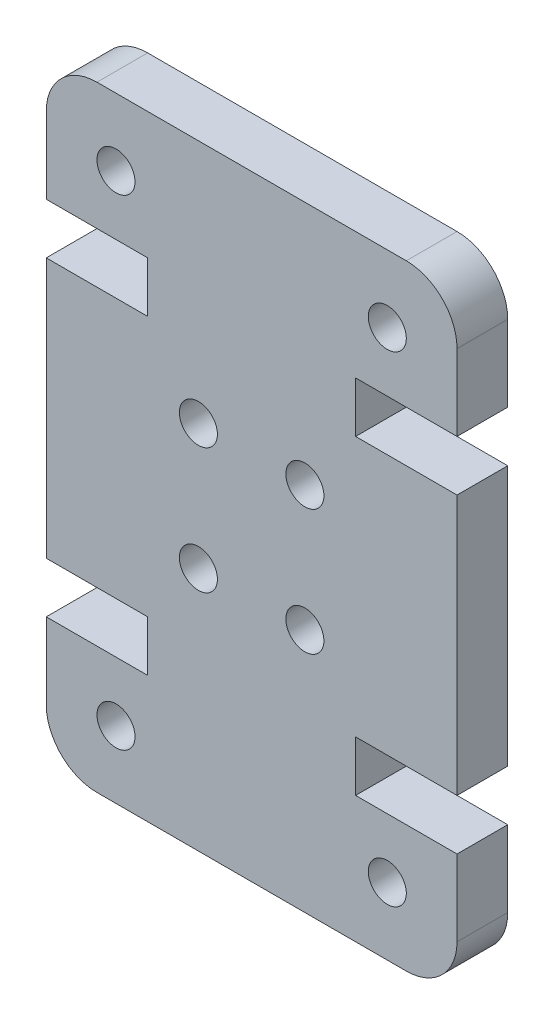
ISO-10303-21;
HEADER;
FILE_DESCRIPTION(('STEP AP214'),'2;1');
FILE_NAME('part.step','',(''),(''),'','','');
FILE_SCHEMA(('AUTOMOTIVE_DESIGN { 1 0 10303 214 1 1 1 1 }'));
ENDSEC;
DATA;
#1=APPLICATION_CONTEXT('core data for automotive mechanical design processes');
#2=APPLICATION_PROTOCOL_DEFINITION('international standard','automotive_design',2000,#1);
#3=PRODUCT_CONTEXT('',#1,'mechanical');
#4=PRODUCT('Part','Part','',(#3));
#5=PRODUCT_RELATED_PRODUCT_CATEGORY('part','',(#4));
#6=PRODUCT_DEFINITION_FORMATION('','',#4);
#7=PRODUCT_DEFINITION_CONTEXT('part definition',#1,'design');
#8=PRODUCT_DEFINITION('design','',#6,#7);
#9=PRODUCT_DEFINITION_SHAPE('','',#8);
#10=(LENGTH_UNIT() NAMED_UNIT(*) SI_UNIT(.MILLI.,.METRE.));
#11=(NAMED_UNIT(*) PLANE_ANGLE_UNIT() SI_UNIT($,.RADIAN.));
#12=(NAMED_UNIT(*) SI_UNIT($,.STERADIAN.) SOLID_ANGLE_UNIT());
#13=UNCERTAINTY_MEASURE_WITH_UNIT(LENGTH_MEASURE(1.E-05),#10,'distance_accuracy_value','');
#14=(GEOMETRIC_REPRESENTATION_CONTEXT(3) GLOBAL_UNCERTAINTY_ASSIGNED_CONTEXT((#13)) GLOBAL_UNIT_ASSIGNED_CONTEXT((#10,
#11,#12)) REPRESENTATION_CONTEXT('',''));
#15=CARTESIAN_POINT('',(0.,0.,0.));
#16=DIRECTION('',(0.,0.,1.));
#17=DIRECTION('',(1.,0.,0.));
#18=AXIS2_PLACEMENT_3D('',#15,#16,#17);
#19=CARTESIAN_POINT('',(14.2,2.,2.));
#20=DIRECTION('',(0.,0.,-1.));
#21=DIRECTION('',(-1.,0.,0.));
#22=AXIS2_PLACEMENT_3D('',#19,#20,#21);
#23=PLANE('',#22);
#24=CARTESIAN_POINT('',(6.00000000000001,9.65355116894447,2.));
#25=DIRECTION('',(0.,0.,1.));
#26=DIRECTION('',(1.,0.,0.));
#27=AXIS2_PLACEMENT_3D('',#24,#25,#26);
#28=CIRCLE('',#27,0.749999999999999);
#29=CARTESIAN_POINT('',(6.75,9.65355116894447,2.));
#30=VERTEX_POINT('',#29);
#31=EDGE_CURVE('E464',#30,#30,#28,.T.);
#32=ORIENTED_EDGE('',*,*,#31,.F.);
#33=EDGE_LOOP('',(#32));
#34=FACE_BOUND('',#33,.T.);
#35=CARTESIAN_POINT('',(10.2,14.6064488310555,2.));
#36=DIRECTION('',(0.,0.,1.));
#37=DIRECTION('',(1.,0.,0.));
#38=AXIS2_PLACEMENT_3D('',#35,#36,#37);
#39=CIRCLE('',#38,0.749999999999998);
#40=CARTESIAN_POINT('',(10.95,14.6064488310555,2.));
#41=VERTEX_POINT('',#40);
#42=EDGE_CURVE('E476',#41,#41,#39,.T.);
#43=ORIENTED_EDGE('',*,*,#42,.F.);
#44=EDGE_LOOP('',(#43));
#45=FACE_BOUND('',#44,.T.);
#46=CARTESIAN_POINT('',(2.75000000000003,21.606448831055,2.));
#47=DIRECTION('',(0.,0.,1.));
#48=DIRECTION('',(-1.,0.,0.));
#49=AXIS2_PLACEMENT_3D('',#46,#47,#48);
#50=CIRCLE('',#49,0.749999999999999);
#51=CARTESIAN_POINT('',(2.00000000000003,21.606448831055,2.));
#52=VERTEX_POINT('',#51);
#53=EDGE_CURVE('E488',#52,#52,#50,.T.);
#54=ORIENTED_EDGE('',*,*,#53,.F.);
#55=EDGE_LOOP('',(#54));
#56=FACE_BOUND('',#55,.T.);
#57=CARTESIAN_POINT('',(13.45,2.65355116894501,2.));
#58=DIRECTION('',(0.,0.,1.));
#59=DIRECTION('',(-1.,0.,0.));
#60=AXIS2_PLACEMENT_3D('',#57,#58,#59);
#61=CIRCLE('',#60,0.750000000000004);
#62=CARTESIAN_POINT('',(12.7,2.65355116894501,2.));
#63=VERTEX_POINT('',#62);
#64=EDGE_CURVE('E230',#63,#63,#61,.T.);
#65=ORIENTED_EDGE('',*,*,#64,.F.);
#66=EDGE_LOOP('',(#65));
#67=FACE_BOUND('',#66,.T.);
#68=CARTESIAN_POINT('',(14.2,2.,2.));
#69=DIRECTION('',(0.,0.,1.));
#70=DIRECTION('',(-1.,0.,0.));
#71=AXIS2_PLACEMENT_3D('',#68,#69,#70);
#72=CIRCLE('',#71,2.);
#73=CARTESIAN_POINT('',(14.2,0.,2.));
#74=VERTEX_POINT('',#73);
#75=CARTESIAN_POINT('',(16.2,2.,2.));
#76=VERTEX_POINT('',#75);
#77=EDGE_CURVE('E273',#74,#76,#72,.T.);
#78=ORIENTED_EDGE('',*,*,#77,.T.);
#79=DIRECTION('',(0.,1.,0.));
#80=VECTOR('',#79,1.);
#81=CARTESIAN_POINT('',(16.2,2.,2.));
#82=LINE('',#81,#80);
#83=CARTESIAN_POINT('',(16.2,4.99999999999945,2.));
#84=VERTEX_POINT('',#83);
#85=EDGE_CURVE('E141',#76,#84,#82,.T.);
#86=ORIENTED_EDGE('',*,*,#85,.T.);
#87=DIRECTION('',(-1.,0.,0.));
#88=VECTOR('',#87,1.);
#89=CARTESIAN_POINT('',(12.2,4.99999999999945,2.));
#90=LINE('',#89,#88);
#91=CARTESIAN_POINT('',(12.2,4.99999999999945,2.));
#92=VERTEX_POINT('',#91);
#93=EDGE_CURVE('E336',#84,#92,#90,.T.);
#94=ORIENTED_EDGE('',*,*,#93,.T.);
#95=DIRECTION('',(0.,1.,0.));
#96=VECTOR('',#95,1.);
#97=CARTESIAN_POINT('',(12.2,6.99999999999945,2.));
#98=LINE('',#97,#96);
#99=CARTESIAN_POINT('',(12.2,6.99999999999945,2.));
#100=VERTEX_POINT('',#99);
#101=EDGE_CURVE('E355',#92,#100,#98,.T.);
#102=ORIENTED_EDGE('',*,*,#101,.T.);
#103=DIRECTION('',(1.,0.,0.));
#104=VECTOR('',#103,1.);
#105=CARTESIAN_POINT('',(16.2,6.99999999999945,2.));
#106=LINE('',#105,#104);
#107=CARTESIAN_POINT('',(16.2,6.99999999999945,2.));
#108=VERTEX_POINT('',#107);
#109=EDGE_CURVE('E352',#100,#108,#106,.T.);
#110=ORIENTED_EDGE('',*,*,#109,.T.);
#111=DIRECTION('',(0.,1.,0.));
#112=VECTOR('',#111,1.);
#113=CARTESIAN_POINT('',(16.2,17.2600000000005,2.));
#114=LINE('',#113,#112);
#115=CARTESIAN_POINT('',(16.2,17.2600000000005,2.));
#116=VERTEX_POINT('',#115);
#117=EDGE_CURVE('E354',#108,#116,#114,.T.);
#118=ORIENTED_EDGE('',*,*,#117,.T.);
#119=DIRECTION('',(-1.,0.,0.));
#120=VECTOR('',#119,1.);
#121=CARTESIAN_POINT('',(16.2,17.2600000000005,2.));
#122=LINE('',#121,#120);
#123=CARTESIAN_POINT('',(12.2,17.2600000000005,2.));
#124=VERTEX_POINT('',#123);
#125=EDGE_CURVE('E357',#116,#124,#122,.T.);
#126=ORIENTED_EDGE('',*,*,#125,.T.);
#127=DIRECTION('',(0.,1.,0.));
#128=VECTOR('',#127,1.);
#129=CARTESIAN_POINT('',(12.2,17.2600000000005,2.));
#130=LINE('',#129,#128);
#131=CARTESIAN_POINT('',(12.2,19.2600000000005,2.));
#132=VERTEX_POINT('',#131);
#133=EDGE_CURVE('E363',#124,#132,#130,.T.);
#134=ORIENTED_EDGE('',*,*,#133,.T.);
#135=DIRECTION('',(1.,0.,0.));
#136=VECTOR('',#135,1.);
#137=CARTESIAN_POINT('',(12.2,19.2600000000005,2.));
#138=LINE('',#137,#136);
#139=CARTESIAN_POINT('',(16.2,19.2600000000005,2.));
#140=VERTEX_POINT('',#139);
#141=EDGE_CURVE('E365',#132,#140,#138,.T.);
#142=ORIENTED_EDGE('',*,*,#141,.T.);
#143=DIRECTION('',(0.,1.,0.));
#144=VECTOR('',#143,1.);
#145=CARTESIAN_POINT('',(16.2,22.26,2.));
#146=LINE('',#145,#144);
#147=CARTESIAN_POINT('',(16.2,22.26,2.));
#148=VERTEX_POINT('',#147);
#149=EDGE_CURVE('E367',#140,#148,#146,.T.);
#150=ORIENTED_EDGE('',*,*,#149,.T.);
#151=CARTESIAN_POINT('',(14.2,22.26,2.));
#152=DIRECTION('',(0.,0.,1.));
#153=DIRECTION('',(1.,0.,0.));
#154=AXIS2_PLACEMENT_3D('',#151,#152,#153);
#155=CIRCLE('',#154,2.);
#156=CARTESIAN_POINT('',(14.2,24.26,2.));
#157=VERTEX_POINT('',#156);
#158=EDGE_CURVE('E369',#148,#157,#155,.T.);
#159=ORIENTED_EDGE('',*,*,#158,.T.);
#160=DIRECTION('',(-1.,0.,0.));
#161=VECTOR('',#160,1.);
#162=CARTESIAN_POINT('',(1.99999999999999,24.26,2.));
#163=LINE('',#162,#161);
#164=CARTESIAN_POINT('',(1.99999999999999,24.26,2.));
#165=VERTEX_POINT('',#164);
#166=EDGE_CURVE('E371',#157,#165,#163,.T.);
#167=ORIENTED_EDGE('',*,*,#166,.T.);
#168=CARTESIAN_POINT('',(2.,22.26,2.));
#169=DIRECTION('',(0.,0.,1.));
#170=DIRECTION('',(-1.,0.,0.));
#171=AXIS2_PLACEMENT_3D('',#168,#169,#170);
#172=CIRCLE('',#171,2.);
#173=CARTESIAN_POINT('',(0.,22.26,2.));
#174=VERTEX_POINT('',#173);
#175=EDGE_CURVE('E373',#165,#174,#172,.T.);
#176=ORIENTED_EDGE('',*,*,#175,.T.);
#177=DIRECTION('',(0.,-1.,0.));
#178=VECTOR('',#177,1.);
#179=CARTESIAN_POINT('',(0.,22.26,2.));
#180=LINE('',#179,#178);
#181=CARTESIAN_POINT('',(0.,19.2600000000005,2.));
#182=VERTEX_POINT('',#181);
#183=EDGE_CURVE('E375',#174,#182,#180,.T.);
#184=ORIENTED_EDGE('',*,*,#183,.T.);
#185=DIRECTION('',(1.,0.,0.));
#186=VECTOR('',#185,1.);
#187=CARTESIAN_POINT('',(3.99999999999999,19.2600000000005,2.));
#188=LINE('',#187,#186);
#189=CARTESIAN_POINT('',(3.99999999999999,19.2600000000005,2.));
#190=VERTEX_POINT('',#189);
#191=EDGE_CURVE('E377',#182,#190,#188,.T.);
#192=ORIENTED_EDGE('',*,*,#191,.T.);
#193=DIRECTION('',(0.,-1.,0.));
#194=VECTOR('',#193,1.);
#195=CARTESIAN_POINT('',(3.99999999999999,17.2600000000005,2.));
#196=LINE('',#195,#194);
#197=CARTESIAN_POINT('',(3.99999999999999,17.2600000000005,2.));
#198=VERTEX_POINT('',#197);
#199=EDGE_CURVE('E379',#190,#198,#196,.T.);
#200=ORIENTED_EDGE('',*,*,#199,.T.);
#201=DIRECTION('',(-1.,0.,0.));
#202=VECTOR('',#201,1.);
#203=CARTESIAN_POINT('',(0.,17.2600000000005,2.));
#204=LINE('',#203,#202);
#205=CARTESIAN_POINT('',(0.,17.2600000000005,2.));
#206=VERTEX_POINT('',#205);
#207=EDGE_CURVE('E381',#198,#206,#204,.T.);
#208=ORIENTED_EDGE('',*,*,#207,.T.);
#209=DIRECTION('',(0.,-1.,0.));
#210=VECTOR('',#209,1.);
#211=CARTESIAN_POINT('',(0.,17.2600000000005,2.));
#212=LINE('',#211,#210);
#213=CARTESIAN_POINT('',(0.,6.99999999999945,2.));
#214=VERTEX_POINT('',#213);
#215=EDGE_CURVE('E383',#206,#214,#212,.T.);
#216=ORIENTED_EDGE('',*,*,#215,.T.);
#217=DIRECTION('',(1.,0.,0.));
#218=VECTOR('',#217,1.);
#219=CARTESIAN_POINT('',(0.,6.99999999999945,2.));
#220=LINE('',#219,#218);
#221=CARTESIAN_POINT('',(4.,6.99999999999945,2.));
#222=VERTEX_POINT('',#221);
#223=EDGE_CURVE('E385',#214,#222,#220,.T.);
#224=ORIENTED_EDGE('',*,*,#223,.T.);
#225=DIRECTION('',(0.,-1.,0.));
#226=VECTOR('',#225,1.);
#227=CARTESIAN_POINT('',(4.,6.99999999999945,2.));
#228=LINE('',#227,#226);
#229=CARTESIAN_POINT('',(4.,4.99999999999945,2.));
#230=VERTEX_POINT('',#229);
#231=EDGE_CURVE('E387',#222,#230,#228,.T.);
#232=ORIENTED_EDGE('',*,*,#231,.T.);
#233=DIRECTION('',(-1.,0.,0.));
#234=VECTOR('',#233,1.);
#235=CARTESIAN_POINT('',(4.,4.99999999999945,2.));
#236=LINE('',#235,#234);
#237=CARTESIAN_POINT('',(0.,4.99999999999945,2.));
#238=VERTEX_POINT('',#237);
#239=EDGE_CURVE('E208',#230,#238,#236,.T.);
#240=ORIENTED_EDGE('',*,*,#239,.T.);
#241=DIRECTION('',(0.,-1.,0.));
#242=VECTOR('',#241,1.);
#243=CARTESIAN_POINT('',(0.,2.,2.));
#244=LINE('',#243,#242);
#245=CARTESIAN_POINT('',(0.,2.,2.));
#246=VERTEX_POINT('',#245);
#247=EDGE_CURVE('E202',#238,#246,#244,.T.);
#248=ORIENTED_EDGE('',*,*,#247,.T.);
#249=CARTESIAN_POINT('',(2.,2.,2.));
#250=DIRECTION('',(0.,0.,1.));
#251=DIRECTION('',(1.,0.,0.));
#252=AXIS2_PLACEMENT_3D('',#249,#250,#251);
#253=CIRCLE('',#252,2.);
#254=CARTESIAN_POINT('',(2.,0.,2.));
#255=VERTEX_POINT('',#254);
#256=EDGE_CURVE('E206',#246,#255,#253,.T.);
#257=ORIENTED_EDGE('',*,*,#256,.T.);
#258=DIRECTION('',(1.,0.,0.));
#259=VECTOR('',#258,1.);
#260=CARTESIAN_POINT('',(2.,0.,2.));
#261=LINE('',#260,#259);
#262=EDGE_CURVE('E50',#255,#74,#261,.T.);
#263=ORIENTED_EDGE('',*,*,#262,.T.);
#264=EDGE_LOOP('',(#78,#86,#94,#102,#110,#118,#126,#134,#142,#150,#159,#167,#176,#184,#192,#200,
#208,#216,#224,#232,#240,#248,#257,#263));
#265=FACE_BOUND('',#264,.T.);
#266=CARTESIAN_POINT('',(10.2,9.65355116894447,2.));
#267=DIRECTION('',(0.,0.,1.));
#268=DIRECTION('',(-1.,0.,0.));
#269=AXIS2_PLACEMENT_3D('',#266,#267,#268);
#270=CIRCLE('',#269,0.749999999999998);
#271=CARTESIAN_POINT('',(9.44999999999999,9.65355116894447,2.));
#272=VERTEX_POINT('',#271);
#273=EDGE_CURVE('E494',#272,#272,#270,.T.);
#274=ORIENTED_EDGE('',*,*,#273,.F.);
#275=EDGE_LOOP('',(#274));
#276=FACE_BOUND('',#275,.T.);
#277=CARTESIAN_POINT('',(6.,14.6064488310555,2.));
#278=DIRECTION('',(0.,0.,1.));
#279=DIRECTION('',(-1.,0.,0.));
#280=AXIS2_PLACEMENT_3D('',#277,#278,#279);
#281=CIRCLE('',#280,0.75);
#282=CARTESIAN_POINT('',(5.25,14.6064488310555,2.));
#283=VERTEX_POINT('',#282);
#284=EDGE_CURVE('E482',#283,#283,#281,.T.);
#285=ORIENTED_EDGE('',*,*,#284,.F.);
#286=EDGE_LOOP('',(#285));
#287=FACE_BOUND('',#286,.T.);
#288=CARTESIAN_POINT('',(13.45,21.606448831055,2.));
#289=DIRECTION('',(0.,0.,1.));
#290=DIRECTION('',(1.,0.,0.));
#291=AXIS2_PLACEMENT_3D('',#288,#289,#290);
#292=CIRCLE('',#291,0.750000000000004);
#293=CARTESIAN_POINT('',(14.2,21.606448831055,2.));
#294=VERTEX_POINT('',#293);
#295=EDGE_CURVE('E470',#294,#294,#292,.T.);
#296=ORIENTED_EDGE('',*,*,#295,.F.);
#297=EDGE_LOOP('',(#296));
#298=FACE_BOUND('',#297,.T.);
#299=CARTESIAN_POINT('',(2.75000000000003,2.65355116894501,2.));
#300=DIRECTION('',(0.,0.,1.));
#301=DIRECTION('',(1.,0.,0.));
#302=AXIS2_PLACEMENT_3D('',#299,#300,#301);
#303=CIRCLE('',#302,0.749999999999999);
#304=CARTESIAN_POINT('',(3.50000000000003,2.65355116894501,2.));
#305=VERTEX_POINT('',#304);
#306=EDGE_CURVE('E455',#305,#305,#303,.T.);
#307=ORIENTED_EDGE('',*,*,#306,.F.);
#308=EDGE_LOOP('',(#307));
#309=FACE_BOUND('',#308,.T.);
#310=ADVANCED_FACE('F33',(#34,#45,#56,#67,#265,#276,#287,#298,#309),#23,.F.);
#311=CARTESIAN_POINT('',(14.2,2.,0.));
#312=DIRECTION('',(0.,0.,-1.));
#313=DIRECTION('',(-1.,0.,0.));
#314=AXIS2_PLACEMENT_3D('',#311,#312,#313);
#315=PLANE('',#314);
#316=CARTESIAN_POINT('',(6.00000000000001,9.65355116894447,0.));
#317=DIRECTION('',(0.,0.,1.));
#318=DIRECTION('',(1.,0.,0.));
#319=AXIS2_PLACEMENT_3D('',#316,#317,#318);
#320=CIRCLE('',#319,0.749999999999999);
#321=CARTESIAN_POINT('',(6.75,9.65355116894447,0.));
#322=VERTEX_POINT('',#321);
#323=EDGE_CURVE('E461',#322,#322,#320,.T.);
#324=ORIENTED_EDGE('',*,*,#323,.T.);
#325=EDGE_LOOP('',(#324));
#326=FACE_BOUND('',#325,.T.);
#327=CARTESIAN_POINT('',(10.2,14.6064488310555,0.));
#328=DIRECTION('',(0.,0.,1.));
#329=DIRECTION('',(1.,0.,0.));
#330=AXIS2_PLACEMENT_3D('',#327,#328,#329);
#331=CIRCLE('',#330,0.749999999999998);
#332=CARTESIAN_POINT('',(10.95,14.6064488310555,0.));
#333=VERTEX_POINT('',#332);
#334=EDGE_CURVE('E473',#333,#333,#331,.T.);
#335=ORIENTED_EDGE('',*,*,#334,.T.);
#336=EDGE_LOOP('',(#335));
#337=FACE_BOUND('',#336,.T.);
#338=CARTESIAN_POINT('',(2.75000000000003,21.606448831055,0.));
#339=DIRECTION('',(0.,0.,1.));
#340=DIRECTION('',(-1.,0.,0.));
#341=AXIS2_PLACEMENT_3D('',#338,#339,#340);
#342=CIRCLE('',#341,0.749999999999999);
#343=CARTESIAN_POINT('',(2.00000000000003,21.606448831055,0.));
#344=VERTEX_POINT('',#343);
#345=EDGE_CURVE('E485',#344,#344,#342,.T.);
#346=ORIENTED_EDGE('',*,*,#345,.T.);
#347=EDGE_LOOP('',(#346));
#348=FACE_BOUND('',#347,.T.);
#349=CARTESIAN_POINT('',(13.45,2.65355116894501,0.));
#350=DIRECTION('',(0.,0.,1.));
#351=DIRECTION('',(-1.,0.,0.));
#352=AXIS2_PLACEMENT_3D('',#349,#350,#351);
#353=CIRCLE('',#352,0.750000000000004);
#354=CARTESIAN_POINT('',(12.7,2.65355116894501,0.));
#355=VERTEX_POINT('',#354);
#356=EDGE_CURVE('E497',#355,#355,#353,.T.);
#357=ORIENTED_EDGE('',*,*,#356,.T.);
#358=EDGE_LOOP('',(#357));
#359=FACE_BOUND('',#358,.T.);
#360=CARTESIAN_POINT('',(14.2,2.,0.));
#361=DIRECTION('',(0.,0.,1.));
#362=DIRECTION('',(-1.,0.,0.));
#363=AXIS2_PLACEMENT_3D('',#360,#361,#362);
#364=CIRCLE('',#363,2.);
#365=CARTESIAN_POINT('',(14.2,0.,0.));
#366=VERTEX_POINT('',#365);
#367=CARTESIAN_POINT('',(16.2,2.,0.));
#368=VERTEX_POINT('',#367);
#369=EDGE_CURVE('E226',#366,#368,#364,.T.);
#370=ORIENTED_EDGE('',*,*,#369,.F.);
#371=DIRECTION('',(1.,0.,0.));
#372=VECTOR('',#371,1.);
#373=CARTESIAN_POINT('',(2.,0.,0.));
#374=LINE('',#373,#372);
#375=CARTESIAN_POINT('',(2.,0.,0.));
#376=VERTEX_POINT('',#375);
#377=EDGE_CURVE('E133',#376,#366,#374,.T.);
#378=ORIENTED_EDGE('',*,*,#377,.F.);
#379=CARTESIAN_POINT('',(2.,2.,0.));
#380=DIRECTION('',(0.,0.,1.));
#381=DIRECTION('',(1.,0.,0.));
#382=AXIS2_PLACEMENT_3D('',#379,#380,#381);
#383=CIRCLE('',#382,2.);
#384=CARTESIAN_POINT('',(0.,2.,0.));
#385=VERTEX_POINT('',#384);
#386=EDGE_CURVE('E127',#385,#376,#383,.T.);
#387=ORIENTED_EDGE('',*,*,#386,.F.);
#388=DIRECTION('',(0.,-1.,0.));
#389=VECTOR('',#388,1.);
#390=CARTESIAN_POINT('',(0.,2.,0.));
#391=LINE('',#390,#389);
#392=CARTESIAN_POINT('',(0.,4.99999999999945,0.));
#393=VERTEX_POINT('',#392);
#394=EDGE_CURVE('E216',#393,#385,#391,.T.);
#395=ORIENTED_EDGE('',*,*,#394,.F.);
#396=DIRECTION('',(-1.,0.,0.));
#397=VECTOR('',#396,1.);
#398=CARTESIAN_POINT('',(4.,4.99999999999945,0.));
#399=LINE('',#398,#397);
#400=CARTESIAN_POINT('',(4.,4.99999999999945,0.));
#401=VERTEX_POINT('',#400);
#402=EDGE_CURVE('E268',#401,#393,#399,.T.);
#403=ORIENTED_EDGE('',*,*,#402,.F.);
#404=DIRECTION('',(0.,-1.,0.));
#405=VECTOR('',#404,1.);
#406=CARTESIAN_POINT('',(4.,6.99999999999945,0.));
#407=LINE('',#406,#405);
#408=CARTESIAN_POINT('',(4.,6.99999999999945,0.));
#409=VERTEX_POINT('',#408);
#410=EDGE_CURVE('E266',#409,#401,#407,.T.);
#411=ORIENTED_EDGE('',*,*,#410,.F.);
#412=DIRECTION('',(1.,0.,0.));
#413=VECTOR('',#412,1.);
#414=CARTESIAN_POINT('',(0.,6.99999999999945,0.));
#415=LINE('',#414,#413);
#416=CARTESIAN_POINT('',(0.,6.99999999999945,0.));
#417=VERTEX_POINT('',#416);
#418=EDGE_CURVE('E264',#417,#409,#415,.T.);
#419=ORIENTED_EDGE('',*,*,#418,.F.);
#420=DIRECTION('',(0.,-1.,0.));
#421=VECTOR('',#420,1.);
#422=CARTESIAN_POINT('',(0.,17.2600000000005,0.));
#423=LINE('',#422,#421);
#424=CARTESIAN_POINT('',(0.,17.2600000000005,0.));
#425=VERTEX_POINT('',#424);
#426=EDGE_CURVE('E262',#425,#417,#423,.T.);
#427=ORIENTED_EDGE('',*,*,#426,.F.);
#428=DIRECTION('',(-1.,0.,0.));
#429=VECTOR('',#428,1.);
#430=CARTESIAN_POINT('',(0.,17.2600000000005,0.));
#431=LINE('',#430,#429);
#432=CARTESIAN_POINT('',(3.99999999999999,17.2600000000005,0.));
#433=VERTEX_POINT('',#432);
#434=EDGE_CURVE('E260',#433,#425,#431,.T.);
#435=ORIENTED_EDGE('',*,*,#434,.F.);
#436=DIRECTION('',(0.,-1.,0.));
#437=VECTOR('',#436,1.);
#438=CARTESIAN_POINT('',(3.99999999999999,17.2600000000005,0.));
#439=LINE('',#438,#437);
#440=CARTESIAN_POINT('',(3.99999999999999,19.2600000000005,0.));
#441=VERTEX_POINT('',#440);
#442=EDGE_CURVE('E258',#441,#433,#439,.T.);
#443=ORIENTED_EDGE('',*,*,#442,.F.);
#444=DIRECTION('',(1.,0.,0.));
#445=VECTOR('',#444,1.);
#446=CARTESIAN_POINT('',(3.99999999999999,19.2600000000005,0.));
#447=LINE('',#446,#445);
#448=CARTESIAN_POINT('',(0.,19.2600000000005,0.));
#449=VERTEX_POINT('',#448);
#450=EDGE_CURVE('E256',#449,#441,#447,.T.);
#451=ORIENTED_EDGE('',*,*,#450,.F.);
#452=DIRECTION('',(0.,-1.,0.));
#453=VECTOR('',#452,1.);
#454=CARTESIAN_POINT('',(0.,22.26,0.));
#455=LINE('',#454,#453);
#456=CARTESIAN_POINT('',(0.,22.26,0.));
#457=VERTEX_POINT('',#456);
#458=EDGE_CURVE('E254',#457,#449,#455,.T.);
#459=ORIENTED_EDGE('',*,*,#458,.F.);
#460=CARTESIAN_POINT('',(2.,22.26,0.));
#461=DIRECTION('',(0.,0.,1.));
#462=DIRECTION('',(-1.,0.,0.));
#463=AXIS2_PLACEMENT_3D('',#460,#461,#462);
#464=CIRCLE('',#463,2.);
#465=CARTESIAN_POINT('',(1.99999999999999,24.26,0.));
#466=VERTEX_POINT('',#465);
#467=EDGE_CURVE('E252',#466,#457,#464,.T.);
#468=ORIENTED_EDGE('',*,*,#467,.F.);
#469=DIRECTION('',(-1.,0.,0.));
#470=VECTOR('',#469,1.);
#471=CARTESIAN_POINT('',(1.99999999999999,24.26,0.));
#472=LINE('',#471,#470);
#473=CARTESIAN_POINT('',(14.2,24.26,0.));
#474=VERTEX_POINT('',#473);
#475=EDGE_CURVE('E250',#474,#466,#472,.T.);
#476=ORIENTED_EDGE('',*,*,#475,.F.);
#477=CARTESIAN_POINT('',(14.2,22.26,0.));
#478=DIRECTION('',(0.,0.,1.));
#479=DIRECTION('',(1.,0.,0.));
#480=AXIS2_PLACEMENT_3D('',#477,#478,#479);
#481=CIRCLE('',#480,2.);
#482=CARTESIAN_POINT('',(16.2,22.26,0.));
#483=VERTEX_POINT('',#482);
#484=EDGE_CURVE('E248',#483,#474,#481,.T.);
#485=ORIENTED_EDGE('',*,*,#484,.F.);
#486=DIRECTION('',(0.,1.,0.));
#487=VECTOR('',#486,1.);
#488=CARTESIAN_POINT('',(16.2,22.26,0.));
#489=LINE('',#488,#487);
#490=CARTESIAN_POINT('',(16.2,19.2600000000005,0.));
#491=VERTEX_POINT('',#490);
#492=EDGE_CURVE('E246',#491,#483,#489,.T.);
#493=ORIENTED_EDGE('',*,*,#492,.F.);
#494=DIRECTION('',(1.,0.,0.));
#495=VECTOR('',#494,1.);
#496=CARTESIAN_POINT('',(12.2,19.2600000000005,0.));
#497=LINE('',#496,#495);
#498=CARTESIAN_POINT('',(12.2,19.2600000000005,0.));
#499=VERTEX_POINT('',#498);
#500=EDGE_CURVE('E244',#499,#491,#497,.T.);
#501=ORIENTED_EDGE('',*,*,#500,.F.);
#502=DIRECTION('',(0.,1.,0.));
#503=VECTOR('',#502,1.);
#504=CARTESIAN_POINT('',(12.2,17.2600000000005,0.));
#505=LINE('',#504,#503);
#506=CARTESIAN_POINT('',(12.2,17.2600000000005,0.));
#507=VERTEX_POINT('',#506);
#508=EDGE_CURVE('E242',#507,#499,#505,.T.);
#509=ORIENTED_EDGE('',*,*,#508,.F.);
#510=DIRECTION('',(-1.,0.,0.));
#511=VECTOR('',#510,1.);
#512=CARTESIAN_POINT('',(16.2,17.2600000000005,0.));
#513=LINE('',#512,#511);
#514=CARTESIAN_POINT('',(16.2,17.2600000000005,0.));
#515=VERTEX_POINT('',#514);
#516=EDGE_CURVE('E240',#515,#507,#513,.T.);
#517=ORIENTED_EDGE('',*,*,#516,.F.);
#518=DIRECTION('',(0.,1.,0.));
#519=VECTOR('',#518,1.);
#520=CARTESIAN_POINT('',(16.2,17.2600000000005,0.));
#521=LINE('',#520,#519);
#522=CARTESIAN_POINT('',(16.2,6.99999999999945,0.));
#523=VERTEX_POINT('',#522);
#524=EDGE_CURVE('E238',#523,#515,#521,.T.);
#525=ORIENTED_EDGE('',*,*,#524,.F.);
#526=DIRECTION('',(1.,0.,0.));
#527=VECTOR('',#526,1.);
#528=CARTESIAN_POINT('',(16.2,6.99999999999945,0.));
#529=LINE('',#528,#527);
#530=CARTESIAN_POINT('',(12.2,6.99999999999945,0.));
#531=VERTEX_POINT('',#530);
#532=EDGE_CURVE('E236',#531,#523,#529,.T.);
#533=ORIENTED_EDGE('',*,*,#532,.F.);
#534=DIRECTION('',(0.,1.,0.));
#535=VECTOR('',#534,1.);
#536=CARTESIAN_POINT('',(12.2,6.99999999999945,0.));
#537=LINE('',#536,#535);
#538=CARTESIAN_POINT('',(12.2,4.99999999999945,0.));
#539=VERTEX_POINT('',#538);
#540=EDGE_CURVE('E234',#539,#531,#537,.T.);
#541=ORIENTED_EDGE('',*,*,#540,.F.);
#542=DIRECTION('',(-1.,0.,0.));
#543=VECTOR('',#542,1.);
#544=CARTESIAN_POINT('',(12.2,4.99999999999945,0.));
#545=LINE('',#544,#543);
#546=CARTESIAN_POINT('',(16.2,4.99999999999945,0.));
#547=VERTEX_POINT('',#546);
#548=EDGE_CURVE('E232',#547,#539,#545,.T.);
#549=ORIENTED_EDGE('',*,*,#548,.F.);
#550=DIRECTION('',(0.,1.,0.));
#551=VECTOR('',#550,1.);
#552=CARTESIAN_POINT('',(16.2,2.,0.));
#553=LINE('',#552,#551);
#554=EDGE_CURVE('E229',#368,#547,#553,.T.);
#555=ORIENTED_EDGE('',*,*,#554,.F.);
#556=EDGE_LOOP('',(#370,#378,#387,#395,#403,#411,#419,#427,#435,#443,#451,#459,#468,#476,#485,
#493,#501,#509,#517,#525,#533,#541,#549,#555));
#557=FACE_BOUND('',#556,.T.);
#558=CARTESIAN_POINT('',(10.2,9.65355116894447,0.));
#559=DIRECTION('',(0.,0.,1.));
#560=DIRECTION('',(-1.,0.,0.));
#561=AXIS2_PLACEMENT_3D('',#558,#559,#560);
#562=CIRCLE('',#561,0.749999999999998);
#563=CARTESIAN_POINT('',(9.44999999999999,9.65355116894447,0.));
#564=VERTEX_POINT('',#563);
#565=EDGE_CURVE('E491',#564,#564,#562,.T.);
#566=ORIENTED_EDGE('',*,*,#565,.T.);
#567=EDGE_LOOP('',(#566));
#568=FACE_BOUND('',#567,.T.);
#569=CARTESIAN_POINT('',(6.,14.6064488310555,0.));
#570=DIRECTION('',(0.,0.,1.));
#571=DIRECTION('',(-1.,0.,0.));
#572=AXIS2_PLACEMENT_3D('',#569,#570,#571);
#573=CIRCLE('',#572,0.75);
#574=CARTESIAN_POINT('',(5.25,14.6064488310555,0.));
#575=VERTEX_POINT('',#574);
#576=EDGE_CURVE('E479',#575,#575,#573,.T.);
#577=ORIENTED_EDGE('',*,*,#576,.T.);
#578=EDGE_LOOP('',(#577));
#579=FACE_BOUND('',#578,.T.);
#580=CARTESIAN_POINT('',(13.45,21.606448831055,0.));
#581=DIRECTION('',(0.,0.,1.));
#582=DIRECTION('',(1.,0.,0.));
#583=AXIS2_PLACEMENT_3D('',#580,#581,#582);
#584=CIRCLE('',#583,0.750000000000004);
#585=CARTESIAN_POINT('',(14.2,21.606448831055,0.));
#586=VERTEX_POINT('',#585);
#587=EDGE_CURVE('E467',#586,#586,#584,.T.);
#588=ORIENTED_EDGE('',*,*,#587,.T.);
#589=EDGE_LOOP('',(#588));
#590=FACE_BOUND('',#589,.T.);
#591=CARTESIAN_POINT('',(2.75000000000003,2.65355116894501,0.));
#592=DIRECTION('',(0.,0.,1.));
#593=DIRECTION('',(1.,0.,0.));
#594=AXIS2_PLACEMENT_3D('',#591,#592,#593);
#595=CIRCLE('',#594,0.749999999999999);
#596=CARTESIAN_POINT('',(3.50000000000003,2.65355116894501,0.));
#597=VERTEX_POINT('',#596);
#598=EDGE_CURVE('E458',#597,#597,#595,.T.);
#599=ORIENTED_EDGE('',*,*,#598,.T.);
#600=EDGE_LOOP('',(#599));
#601=FACE_BOUND('',#600,.T.);
#602=ADVANCED_FACE('F340',(#326,#337,#348,#359,#557,#568,#579,#590,#601),#315,.T.);
#603=CARTESIAN_POINT('',(14.2,2.,2.));
#604=DIRECTION('',(0.,0.,-1.));
#605=DIRECTION('',(-1.,0.,0.));
#606=AXIS2_PLACEMENT_3D('',#603,#604,#605);
#607=CYLINDRICAL_SURFACE('',#606,2.);
#608=ORIENTED_EDGE('',*,*,#369,.T.);
#609=DIRECTION('',(0.,0.,-1.));
#610=VECTOR('',#609,1.);
#611=CARTESIAN_POINT('',(16.2,2.,2.));
#612=LINE('',#611,#610);
#613=EDGE_CURVE('E11',#76,#368,#612,.T.);
#614=ORIENTED_EDGE('',*,*,#613,.F.);
#615=ORIENTED_EDGE('',*,*,#77,.F.);
#616=DIRECTION('',(0.,0.,-1.));
#617=VECTOR('',#616,1.);
#618=CARTESIAN_POINT('',(14.2,0.,2.));
#619=LINE('',#618,#617);
#620=EDGE_CURVE('E222',#74,#366,#619,.T.);
#621=ORIENTED_EDGE('',*,*,#620,.T.);
#622=EDGE_LOOP('',(#608,#614,#615,#621));
#623=FACE_BOUND('',#622,.T.);
#624=ADVANCED_FACE('F35',(#623),#607,.T.);
#625=CARTESIAN_POINT('',(16.2,2.,2.));
#626=DIRECTION('',(-1.,0.,0.));
#627=DIRECTION('',(0.,0.,1.));
#628=AXIS2_PLACEMENT_3D('',#625,#626,#627);
#629=PLANE('',#628);
#630=ORIENTED_EDGE('',*,*,#554,.T.);
#631=DIRECTION('',(0.,0.,-1.));
#632=VECTOR('',#631,1.);
#633=CARTESIAN_POINT('',(16.2,4.99999999999945,2.));
#634=LINE('',#633,#632);
#635=EDGE_CURVE('E42',#84,#547,#634,.T.);
#636=ORIENTED_EDGE('',*,*,#635,.F.);
#637=ORIENTED_EDGE('',*,*,#85,.F.);
#638=ORIENTED_EDGE('',*,*,#613,.T.);
#639=EDGE_LOOP('',(#630,#636,#637,#638));
#640=FACE_BOUND('',#639,.T.);
#641=ADVANCED_FACE('F762',(#640),#629,.F.);
#642=CARTESIAN_POINT('',(12.2,4.99999999999945,2.));
#643=DIRECTION('',(0.,-1.,0.));
#644=DIRECTION('',(0.,0.,-1.));
#645=AXIS2_PLACEMENT_3D('',#642,#643,#644);
#646=PLANE('',#645);
#647=ORIENTED_EDGE('',*,*,#548,.T.);
#648=DIRECTION('',(0.,0.,-1.));
#649=VECTOR('',#648,1.);
#650=CARTESIAN_POINT('',(12.2,4.99999999999945,2.));
#651=LINE('',#650,#649);
#652=EDGE_CURVE('E328',#92,#539,#651,.T.);
#653=ORIENTED_EDGE('',*,*,#652,.F.);
#654=ORIENTED_EDGE('',*,*,#93,.F.);
#655=ORIENTED_EDGE('',*,*,#635,.T.);
#656=EDGE_LOOP('',(#647,#653,#654,#655));
#657=FACE_BOUND('',#656,.T.);
#658=ADVANCED_FACE('F334',(#657),#646,.F.);
#659=CARTESIAN_POINT('',(12.2,6.99999999999945,2.));
#660=DIRECTION('',(-1.,0.,0.));
#661=DIRECTION('',(0.,0.,1.));
#662=AXIS2_PLACEMENT_3D('',#659,#660,#661);
#663=PLANE('',#662);
#664=ORIENTED_EDGE('',*,*,#540,.T.);
#665=DIRECTION('',(0.,0.,-1.));
#666=VECTOR('',#665,1.);
#667=CARTESIAN_POINT('',(12.2,6.99999999999945,2.));
#668=LINE('',#667,#666);
#669=EDGE_CURVE('E325',#100,#531,#668,.T.);
#670=ORIENTED_EDGE('',*,*,#669,.F.);
#671=ORIENTED_EDGE('',*,*,#101,.F.);
#672=ORIENTED_EDGE('',*,*,#652,.T.);
#673=EDGE_LOOP('',(#664,#670,#671,#672));
#674=FACE_BOUND('',#673,.T.);
#675=ADVANCED_FACE('F346',(#674),#663,.F.);
#676=CARTESIAN_POINT('',(16.2,6.99999999999945,2.));
#677=DIRECTION('',(0.,1.,0.));
#678=DIRECTION('',(-1.,0.,0.));
#679=AXIS2_PLACEMENT_3D('',#676,#677,#678);
#680=PLANE('',#679);
#681=ORIENTED_EDGE('',*,*,#532,.T.);
#682=DIRECTION('',(0.,0.,-1.));
#683=VECTOR('',#682,1.);
#684=CARTESIAN_POINT('',(16.2,6.99999999999945,2.));
#685=LINE('',#684,#683);
#686=EDGE_CURVE('E322',#108,#523,#685,.T.);
#687=ORIENTED_EDGE('',*,*,#686,.F.);
#688=ORIENTED_EDGE('',*,*,#109,.F.);
#689=ORIENTED_EDGE('',*,*,#669,.T.);
#690=EDGE_LOOP('',(#681,#687,#688,#689));
#691=FACE_BOUND('',#690,.T.);
#692=ADVANCED_FACE('F350',(#691),#680,.F.);
#693=CARTESIAN_POINT('',(16.2,17.2600000000005,2.));
#694=DIRECTION('',(-1.,0.,0.));
#695=DIRECTION('',(0.,0.,1.));
#696=AXIS2_PLACEMENT_3D('',#693,#694,#695);
#697=PLANE('',#696);
#698=ORIENTED_EDGE('',*,*,#524,.T.);
#699=DIRECTION('',(0.,0.,-1.));
#700=VECTOR('',#699,1.);
#701=CARTESIAN_POINT('',(16.2,17.2600000000005,2.));
#702=LINE('',#701,#700);
#703=EDGE_CURVE('E319',#116,#515,#702,.T.);
#704=ORIENTED_EDGE('',*,*,#703,.F.);
#705=ORIENTED_EDGE('',*,*,#117,.F.);
#706=ORIENTED_EDGE('',*,*,#686,.T.);
#707=EDGE_LOOP('',(#698,#704,#705,#706));
#708=FACE_BOUND('',#707,.T.);
#709=ADVANCED_FACE('F727',(#708),#697,.F.);
#710=CARTESIAN_POINT('',(16.2,17.2600000000005,2.));
#711=DIRECTION('',(0.,-1.,0.));
#712=DIRECTION('',(0.,0.,-1.));
#713=AXIS2_PLACEMENT_3D('',#710,#711,#712);
#714=PLANE('',#713);
#715=ORIENTED_EDGE('',*,*,#516,.T.);
#716=DIRECTION('',(0.,0.,-1.));
#717=VECTOR('',#716,1.);
#718=CARTESIAN_POINT('',(12.2,17.2600000000005,2.));
#719=LINE('',#718,#717);
#720=EDGE_CURVE('E316',#124,#507,#719,.T.);
#721=ORIENTED_EDGE('',*,*,#720,.F.);
#722=ORIENTED_EDGE('',*,*,#125,.F.);
#723=ORIENTED_EDGE('',*,*,#703,.T.);
#724=EDGE_LOOP('',(#715,#721,#722,#723));
#725=FACE_BOUND('',#724,.T.);
#726=ADVANCED_FACE('F717',(#725),#714,.F.);
#727=CARTESIAN_POINT('',(12.2,17.2600000000005,2.));
#728=DIRECTION('',(-1.,0.,0.));
#729=DIRECTION('',(0.,0.,1.));
#730=AXIS2_PLACEMENT_3D('',#727,#728,#729);
#731=PLANE('',#730);
#732=ORIENTED_EDGE('',*,*,#508,.T.);
#733=DIRECTION('',(0.,0.,-1.));
#734=VECTOR('',#733,1.);
#735=CARTESIAN_POINT('',(12.2,19.2600000000005,2.));
#736=LINE('',#735,#734);
#737=EDGE_CURVE('E313',#132,#499,#736,.T.);
#738=ORIENTED_EDGE('',*,*,#737,.F.);
#739=ORIENTED_EDGE('',*,*,#133,.F.);
#740=ORIENTED_EDGE('',*,*,#720,.T.);
#741=EDGE_LOOP('',(#732,#738,#739,#740));
#742=FACE_BOUND('',#741,.T.);
#743=ADVANCED_FACE('F707',(#742),#731,.F.);
#744=CARTESIAN_POINT('',(12.2,19.2600000000005,2.));
#745=DIRECTION('',(0.,1.,0.));
#746=DIRECTION('',(0.,0.,1.));
#747=AXIS2_PLACEMENT_3D('',#744,#745,#746);
#748=PLANE('',#747);
#749=ORIENTED_EDGE('',*,*,#500,.T.);
#750=DIRECTION('',(0.,0.,-1.));
#751=VECTOR('',#750,1.);
#752=CARTESIAN_POINT('',(16.2,19.2600000000005,2.));
#753=LINE('',#752,#751);
#754=EDGE_CURVE('E310',#140,#491,#753,.T.);
#755=ORIENTED_EDGE('',*,*,#754,.F.);
#756=ORIENTED_EDGE('',*,*,#141,.F.);
#757=ORIENTED_EDGE('',*,*,#737,.T.);
#758=EDGE_LOOP('',(#749,#755,#756,#757));
#759=FACE_BOUND('',#758,.T.);
#760=ADVANCED_FACE('F697',(#759),#748,.F.);
#761=CARTESIAN_POINT('',(16.2,22.26,2.));
#762=DIRECTION('',(-1.,0.,0.));
#763=DIRECTION('',(0.,0.,1.));
#764=AXIS2_PLACEMENT_3D('',#761,#762,#763);
#765=PLANE('',#764);
#766=ORIENTED_EDGE('',*,*,#492,.T.);
#767=DIRECTION('',(0.,0.,-1.));
#768=VECTOR('',#767,1.);
#769=CARTESIAN_POINT('',(16.2,22.26,2.));
#770=LINE('',#769,#768);
#771=EDGE_CURVE('E307',#148,#483,#770,.T.);
#772=ORIENTED_EDGE('',*,*,#771,.F.);
#773=ORIENTED_EDGE('',*,*,#149,.F.);
#774=ORIENTED_EDGE('',*,*,#754,.T.);
#775=EDGE_LOOP('',(#766,#772,#773,#774));
#776=FACE_BOUND('',#775,.T.);
#777=ADVANCED_FACE('F687',(#776),#765,.F.);
#778=CARTESIAN_POINT('',(14.2,22.26,2.));
#779=DIRECTION('',(0.,0.,-1.));
#780=DIRECTION('',(-1.,0.,0.));
#781=AXIS2_PLACEMENT_3D('',#778,#779,#780);
#782=CYLINDRICAL_SURFACE('',#781,2.);
#783=ORIENTED_EDGE('',*,*,#484,.T.);
#784=DIRECTION('',(0.,0.,-1.));
#785=VECTOR('',#784,1.);
#786=CARTESIAN_POINT('',(14.2,24.26,2.));
#787=LINE('',#786,#785);
#788=EDGE_CURVE('E304',#157,#474,#787,.T.);
#789=ORIENTED_EDGE('',*,*,#788,.F.);
#790=ORIENTED_EDGE('',*,*,#158,.F.);
#791=ORIENTED_EDGE('',*,*,#771,.T.);
#792=EDGE_LOOP('',(#783,#789,#790,#791));
#793=FACE_BOUND('',#792,.T.);
#794=ADVANCED_FACE('F677',(#793),#782,.T.);
#795=CARTESIAN_POINT('',(1.99999999999999,24.26,2.));
#796=DIRECTION('',(0.,-1.,0.));
#797=DIRECTION('',(0.,0.,-1.));
#798=AXIS2_PLACEMENT_3D('',#795,#796,#797);
#799=PLANE('',#798);
#800=ORIENTED_EDGE('',*,*,#475,.T.);
#801=DIRECTION('',(0.,0.,-1.));
#802=VECTOR('',#801,1.);
#803=CARTESIAN_POINT('',(1.99999999999999,24.26,2.));
#804=LINE('',#803,#802);
#805=EDGE_CURVE('E301',#165,#466,#804,.T.);
#806=ORIENTED_EDGE('',*,*,#805,.F.);
#807=ORIENTED_EDGE('',*,*,#166,.F.);
#808=ORIENTED_EDGE('',*,*,#788,.T.);
#809=EDGE_LOOP('',(#800,#806,#807,#808));
#810=FACE_BOUND('',#809,.T.);
#811=ADVANCED_FACE('F667',(#810),#799,.F.);
#812=CARTESIAN_POINT('',(2.,22.26,2.));
#813=DIRECTION('',(0.,0.,-1.));
#814=DIRECTION('',(-1.,0.,0.));
#815=AXIS2_PLACEMENT_3D('',#812,#813,#814);
#816=CYLINDRICAL_SURFACE('',#815,2.);
#817=ORIENTED_EDGE('',*,*,#467,.T.);
#818=DIRECTION('',(0.,0.,-1.));
#819=VECTOR('',#818,1.);
#820=CARTESIAN_POINT('',(0.,22.26,2.));
#821=LINE('',#820,#819);
#822=EDGE_CURVE('E298',#174,#457,#821,.T.);
#823=ORIENTED_EDGE('',*,*,#822,.F.);
#824=ORIENTED_EDGE('',*,*,#175,.F.);
#825=ORIENTED_EDGE('',*,*,#805,.T.);
#826=EDGE_LOOP('',(#817,#823,#824,#825));
#827=FACE_BOUND('',#826,.T.);
#828=ADVANCED_FACE('F657',(#827),#816,.T.);
#829=CARTESIAN_POINT('',(0.,22.26,2.));
#830=DIRECTION('',(1.,0.,0.));
#831=DIRECTION('',(0.,1.,0.));
#832=AXIS2_PLACEMENT_3D('',#829,#830,#831);
#833=PLANE('',#832);
#834=ORIENTED_EDGE('',*,*,#458,.T.);
#835=DIRECTION('',(0.,0.,-1.));
#836=VECTOR('',#835,1.);
#837=CARTESIAN_POINT('',(0.,19.2600000000005,2.));
#838=LINE('',#837,#836);
#839=EDGE_CURVE('E295',#182,#449,#838,.T.);
#840=ORIENTED_EDGE('',*,*,#839,.F.);
#841=ORIENTED_EDGE('',*,*,#183,.F.);
#842=ORIENTED_EDGE('',*,*,#822,.T.);
#843=EDGE_LOOP('',(#834,#840,#841,#842));
#844=FACE_BOUND('',#843,.T.);
#845=ADVANCED_FACE('F647',(#844),#833,.F.);
#846=CARTESIAN_POINT('',(3.99999999999999,19.2600000000005,2.));
#847=DIRECTION('',(0.,1.,0.));
#848=DIRECTION('',(-1.,0.,0.));
#849=AXIS2_PLACEMENT_3D('',#846,#847,#848);
#850=PLANE('',#849);
#851=ORIENTED_EDGE('',*,*,#450,.T.);
#852=DIRECTION('',(0.,0.,-1.));
#853=VECTOR('',#852,1.);
#854=CARTESIAN_POINT('',(3.99999999999999,19.2600000000005,2.));
#855=LINE('',#854,#853);
#856=EDGE_CURVE('E292',#190,#441,#855,.T.);
#857=ORIENTED_EDGE('',*,*,#856,.F.);
#858=ORIENTED_EDGE('',*,*,#191,.F.);
#859=ORIENTED_EDGE('',*,*,#839,.T.);
#860=EDGE_LOOP('',(#851,#857,#858,#859));
#861=FACE_BOUND('',#860,.T.);
#862=ADVANCED_FACE('F637',(#861),#850,.F.);
#863=CARTESIAN_POINT('',(3.99999999999999,17.2600000000005,2.));
#864=DIRECTION('',(1.,0.,0.));
#865=DIRECTION('',(0.,0.,-1.));
#866=AXIS2_PLACEMENT_3D('',#863,#864,#865);
#867=PLANE('',#866);
#868=ORIENTED_EDGE('',*,*,#442,.T.);
#869=DIRECTION('',(0.,0.,-1.));
#870=VECTOR('',#869,1.);
#871=CARTESIAN_POINT('',(3.99999999999999,17.2600000000005,2.));
#872=LINE('',#871,#870);
#873=EDGE_CURVE('E289',#198,#433,#872,.T.);
#874=ORIENTED_EDGE('',*,*,#873,.F.);
#875=ORIENTED_EDGE('',*,*,#199,.F.);
#876=ORIENTED_EDGE('',*,*,#856,.T.);
#877=EDGE_LOOP('',(#868,#874,#875,#876));
#878=FACE_BOUND('',#877,.T.);
#879=ADVANCED_FACE('F627',(#878),#867,.F.);
#880=CARTESIAN_POINT('',(0.,17.2600000000005,2.));
#881=DIRECTION('',(0.,-1.,0.));
#882=DIRECTION('',(1.,0.,0.));
#883=AXIS2_PLACEMENT_3D('',#880,#881,#882);
#884=PLANE('',#883);
#885=ORIENTED_EDGE('',*,*,#434,.T.);
#886=DIRECTION('',(0.,0.,-1.));
#887=VECTOR('',#886,1.);
#888=CARTESIAN_POINT('',(0.,17.2600000000005,2.));
#889=LINE('',#888,#887);
#890=EDGE_CURVE('E286',#206,#425,#889,.T.);
#891=ORIENTED_EDGE('',*,*,#890,.F.);
#892=ORIENTED_EDGE('',*,*,#207,.F.);
#893=ORIENTED_EDGE('',*,*,#873,.T.);
#894=EDGE_LOOP('',(#885,#891,#892,#893));
#895=FACE_BOUND('',#894,.T.);
#896=ADVANCED_FACE('F617',(#895),#884,.F.);
#897=CARTESIAN_POINT('',(0.,17.2600000000005,2.));
#898=DIRECTION('',(1.,0.,0.));
#899=DIRECTION('',(0.,1.,0.));
#900=AXIS2_PLACEMENT_3D('',#897,#898,#899);
#901=PLANE('',#900);
#902=ORIENTED_EDGE('',*,*,#426,.T.);
#903=DIRECTION('',(0.,0.,-1.));
#904=VECTOR('',#903,1.);
#905=CARTESIAN_POINT('',(0.,6.99999999999945,2.));
#906=LINE('',#905,#904);
#907=EDGE_CURVE('E283',#214,#417,#906,.T.);
#908=ORIENTED_EDGE('',*,*,#907,.F.);
#909=ORIENTED_EDGE('',*,*,#215,.F.);
#910=ORIENTED_EDGE('',*,*,#890,.T.);
#911=EDGE_LOOP('',(#902,#908,#909,#910));
#912=FACE_BOUND('',#911,.T.);
#913=ADVANCED_FACE('F607',(#912),#901,.F.);
#914=CARTESIAN_POINT('',(0.,6.99999999999945,2.));
#915=DIRECTION('',(0.,1.,0.));
#916=DIRECTION('',(0.,0.,1.));
#917=AXIS2_PLACEMENT_3D('',#914,#915,#916);
#918=PLANE('',#917);
#919=ORIENTED_EDGE('',*,*,#418,.T.);
#920=DIRECTION('',(0.,0.,-1.));
#921=VECTOR('',#920,1.);
#922=CARTESIAN_POINT('',(4.,6.99999999999945,2.));
#923=LINE('',#922,#921);
#924=EDGE_CURVE('E280',#222,#409,#923,.T.);
#925=ORIENTED_EDGE('',*,*,#924,.F.);
#926=ORIENTED_EDGE('',*,*,#223,.F.);
#927=ORIENTED_EDGE('',*,*,#907,.T.);
#928=EDGE_LOOP('',(#919,#925,#926,#927));
#929=FACE_BOUND('',#928,.T.);
#930=ADVANCED_FACE('F598',(#929),#918,.F.);
#931=CARTESIAN_POINT('',(4.,6.99999999999945,2.));
#932=DIRECTION('',(1.,0.,0.));
#933=DIRECTION('',(0.,0.,-1.));
#934=AXIS2_PLACEMENT_3D('',#931,#932,#933);
#935=PLANE('',#934);
#936=ORIENTED_EDGE('',*,*,#410,.T.);
#937=DIRECTION('',(0.,0.,-1.));
#938=VECTOR('',#937,1.);
#939=CARTESIAN_POINT('',(4.,4.99999999999945,2.));
#940=LINE('',#939,#938);
#941=EDGE_CURVE('E277',#230,#401,#940,.T.);
#942=ORIENTED_EDGE('',*,*,#941,.F.);
#943=ORIENTED_EDGE('',*,*,#231,.F.);
#944=ORIENTED_EDGE('',*,*,#924,.T.);
#945=EDGE_LOOP('',(#936,#942,#943,#944));
#946=FACE_BOUND('',#945,.T.);
#947=ADVANCED_FACE('F393',(#946),#935,.F.);
#948=CARTESIAN_POINT('',(4.,4.99999999999945,2.));
#949=DIRECTION('',(0.,-1.,0.));
#950=DIRECTION('',(0.,0.,-1.));
#951=AXIS2_PLACEMENT_3D('',#948,#949,#950);
#952=PLANE('',#951);
#953=ORIENTED_EDGE('',*,*,#402,.T.);
#954=DIRECTION('',(0.,0.,-1.));
#955=VECTOR('',#954,1.);
#956=CARTESIAN_POINT('',(0.,4.99999999999945,2.));
#957=LINE('',#956,#955);
#958=EDGE_CURVE('E217',#238,#393,#957,.T.);
#959=ORIENTED_EDGE('',*,*,#958,.F.);
#960=ORIENTED_EDGE('',*,*,#239,.F.);
#961=ORIENTED_EDGE('',*,*,#941,.T.);
#962=EDGE_LOOP('',(#953,#959,#960,#961));
#963=FACE_BOUND('',#962,.T.);
#964=ADVANCED_FACE('F397',(#963),#952,.F.);
#965=CARTESIAN_POINT('',(0.,2.,2.));
#966=DIRECTION('',(1.,0.,0.));
#967=DIRECTION('',(0.,0.,-1.));
#968=AXIS2_PLACEMENT_3D('',#965,#966,#967);
#969=PLANE('',#968);
#970=ORIENTED_EDGE('',*,*,#394,.T.);
#971=DIRECTION('',(0.,0.,-1.));
#972=VECTOR('',#971,1.);
#973=CARTESIAN_POINT('',(0.,2.,2.));
#974=LINE('',#973,#972);
#975=EDGE_CURVE('E213',#246,#385,#974,.T.);
#976=ORIENTED_EDGE('',*,*,#975,.F.);
#977=ORIENTED_EDGE('',*,*,#247,.F.);
#978=ORIENTED_EDGE('',*,*,#958,.T.);
#979=EDGE_LOOP('',(#970,#976,#977,#978));
#980=FACE_BOUND('',#979,.T.);
#981=ADVANCED_FACE('F214',(#980),#969,.F.);
#982=CARTESIAN_POINT('',(2.,2.,2.));
#983=DIRECTION('',(0.,0.,-1.));
#984=DIRECTION('',(-1.,0.,0.));
#985=AXIS2_PLACEMENT_3D('',#982,#983,#984);
#986=CYLINDRICAL_SURFACE('',#985,2.);
#987=ORIENTED_EDGE('',*,*,#386,.T.);
#988=DIRECTION('',(0.,0.,-1.));
#989=VECTOR('',#988,1.);
#990=CARTESIAN_POINT('',(2.,0.,2.));
#991=LINE('',#990,#989);
#992=EDGE_CURVE('E218',#255,#376,#991,.T.);
#993=ORIENTED_EDGE('',*,*,#992,.F.);
#994=ORIENTED_EDGE('',*,*,#256,.F.);
#995=ORIENTED_EDGE('',*,*,#975,.T.);
#996=EDGE_LOOP('',(#987,#993,#994,#995));
#997=FACE_BOUND('',#996,.T.);
#998=ADVANCED_FACE('F220',(#997),#986,.T.);
#999=CARTESIAN_POINT('',(2.,0.,2.));
#1000=DIRECTION('',(0.,1.,0.));
#1001=DIRECTION('',(-1.,0.,0.));
#1002=AXIS2_PLACEMENT_3D('',#999,#1000,#1001);
#1003=PLANE('',#1002);
#1004=ORIENTED_EDGE('',*,*,#377,.T.);
#1005=ORIENTED_EDGE('',*,*,#620,.F.);
#1006=ORIENTED_EDGE('',*,*,#262,.F.);
#1007=ORIENTED_EDGE('',*,*,#992,.T.);
#1008=EDGE_LOOP('',(#1004,#1005,#1006,#1007));
#1009=FACE_BOUND('',#1008,.T.);
#1010=ADVANCED_FACE('F401',(#1009),#1003,.F.);
#1011=CARTESIAN_POINT('',(13.45,2.65355116894501,2.));
#1012=DIRECTION('',(0.,0.,-1.));
#1013=DIRECTION('',(-1.,0.,0.));
#1014=AXIS2_PLACEMENT_3D('',#1011,#1012,#1013);
#1015=CYLINDRICAL_SURFACE('',#1014,0.750000000000004);
#1016=ORIENTED_EDGE('',*,*,#64,.T.);
#1017=EDGE_LOOP('',(#1016));
#1018=FACE_BOUND('',#1017,.T.);
#1019=ORIENTED_EDGE('',*,*,#356,.F.);
#1020=EDGE_LOOP('',(#1019));
#1021=FACE_BOUND('',#1020,.T.);
#1022=ADVANCED_FACE('F403',(#1018,#1021),#1015,.F.);
#1023=CARTESIAN_POINT('',(10.2,9.65355116894447,2.));
#1024=DIRECTION('',(0.,0.,-1.));
#1025=DIRECTION('',(-1.,0.,0.));
#1026=AXIS2_PLACEMENT_3D('',#1023,#1024,#1025);
#1027=CYLINDRICAL_SURFACE('',#1026,0.749999999999998);
#1028=ORIENTED_EDGE('',*,*,#273,.T.);
#1029=EDGE_LOOP('',(#1028));
#1030=FACE_BOUND('',#1029,.T.);
#1031=ORIENTED_EDGE('',*,*,#565,.F.);
#1032=EDGE_LOOP('',(#1031));
#1033=FACE_BOUND('',#1032,.T.);
#1034=ADVANCED_FACE('F409',(#1030,#1033),#1027,.F.);
#1035=CARTESIAN_POINT('',(2.75000000000003,21.606448831055,2.));
#1036=DIRECTION('',(0.,0.,-1.));
#1037=DIRECTION('',(-1.,0.,0.));
#1038=AXIS2_PLACEMENT_3D('',#1035,#1036,#1037);
#1039=CYLINDRICAL_SURFACE('',#1038,0.749999999999999);
#1040=ORIENTED_EDGE('',*,*,#53,.T.);
#1041=EDGE_LOOP('',(#1040));
#1042=FACE_BOUND('',#1041,.T.);
#1043=ORIENTED_EDGE('',*,*,#345,.F.);
#1044=EDGE_LOOP('',(#1043));
#1045=FACE_BOUND('',#1044,.T.);
#1046=ADVANCED_FACE('F426',(#1042,#1045),#1039,.F.);
#1047=CARTESIAN_POINT('',(6.,14.6064488310555,2.));
#1048=DIRECTION('',(0.,0.,-1.));
#1049=DIRECTION('',(-1.,0.,0.));
#1050=AXIS2_PLACEMENT_3D('',#1047,#1048,#1049);
#1051=CYLINDRICAL_SURFACE('',#1050,0.75);
#1052=ORIENTED_EDGE('',*,*,#284,.T.);
#1053=EDGE_LOOP('',(#1052));
#1054=FACE_BOUND('',#1053,.T.);
#1055=ORIENTED_EDGE('',*,*,#576,.F.);
#1056=EDGE_LOOP('',(#1055));
#1057=FACE_BOUND('',#1056,.T.);
#1058=ADVANCED_FACE('F430',(#1054,#1057),#1051,.F.);
#1059=CARTESIAN_POINT('',(10.2,14.6064488310555,2.));
#1060=DIRECTION('',(0.,0.,-1.));
#1061=DIRECTION('',(-1.,0.,0.));
#1062=AXIS2_PLACEMENT_3D('',#1059,#1060,#1061);
#1063=CYLINDRICAL_SURFACE('',#1062,0.749999999999998);
#1064=ORIENTED_EDGE('',*,*,#42,.T.);
#1065=EDGE_LOOP('',(#1064));
#1066=FACE_BOUND('',#1065,.T.);
#1067=ORIENTED_EDGE('',*,*,#334,.F.);
#1068=EDGE_LOOP('',(#1067));
#1069=FACE_BOUND('',#1068,.T.);
#1070=ADVANCED_FACE('F434',(#1066,#1069),#1063,.F.);
#1071=CARTESIAN_POINT('',(13.45,21.606448831055,2.));
#1072=DIRECTION('',(0.,0.,-1.));
#1073=DIRECTION('',(-1.,0.,0.));
#1074=AXIS2_PLACEMENT_3D('',#1071,#1072,#1073);
#1075=CYLINDRICAL_SURFACE('',#1074,0.750000000000004);
#1076=ORIENTED_EDGE('',*,*,#295,.T.);
#1077=EDGE_LOOP('',(#1076));
#1078=FACE_BOUND('',#1077,.T.);
#1079=ORIENTED_EDGE('',*,*,#587,.F.);
#1080=EDGE_LOOP('',(#1079));
#1081=FACE_BOUND('',#1080,.T.);
#1082=ADVANCED_FACE('F438',(#1078,#1081),#1075,.F.);
#1083=CARTESIAN_POINT('',(6.00000000000001,9.65355116894447,2.));
#1084=DIRECTION('',(0.,0.,-1.));
#1085=DIRECTION('',(-1.,0.,0.));
#1086=AXIS2_PLACEMENT_3D('',#1083,#1084,#1085);
#1087=CYLINDRICAL_SURFACE('',#1086,0.749999999999999);
#1088=ORIENTED_EDGE('',*,*,#31,.T.);
#1089=EDGE_LOOP('',(#1088));
#1090=FACE_BOUND('',#1089,.T.);
#1091=ORIENTED_EDGE('',*,*,#323,.F.);
#1092=EDGE_LOOP('',(#1091));
#1093=FACE_BOUND('',#1092,.T.);
#1094=ADVANCED_FACE('F442',(#1090,#1093),#1087,.F.);
#1095=CARTESIAN_POINT('',(2.75000000000003,2.65355116894501,2.));
#1096=DIRECTION('',(0.,0.,-1.));
#1097=DIRECTION('',(-1.,0.,0.));
#1098=AXIS2_PLACEMENT_3D('',#1095,#1096,#1097);
#1099=CYLINDRICAL_SURFACE('',#1098,0.749999999999999);
#1100=ORIENTED_EDGE('',*,*,#306,.T.);
#1101=EDGE_LOOP('',(#1100));
#1102=FACE_BOUND('',#1101,.T.);
#1103=ORIENTED_EDGE('',*,*,#598,.F.);
#1104=EDGE_LOOP('',(#1103));
#1105=FACE_BOUND('',#1104,.T.);
#1106=ADVANCED_FACE('F446',(#1102,#1105),#1099,.F.);
#1107=CLOSED_SHELL('',(#310,#602,#624,#641,#658,#675,#692,#709,#726,#743,#760,#777,#794,#811,
#828,#845,#862,#879,#896,#913,#930,#947,#964,#981,#998,#1010,#1022,#1034,#1046,#1058,#1070,
#1082,#1094,#1106));
#1108=MANIFOLD_SOLID_BREP('B2',#1107);
#1109=ADVANCED_BREP_SHAPE_REPRESENTATION('',(#18,#1108),#14);
#1110=SHAPE_DEFINITION_REPRESENTATION(#9,#1109);
ENDSEC;
END-ISO-10303-21;
